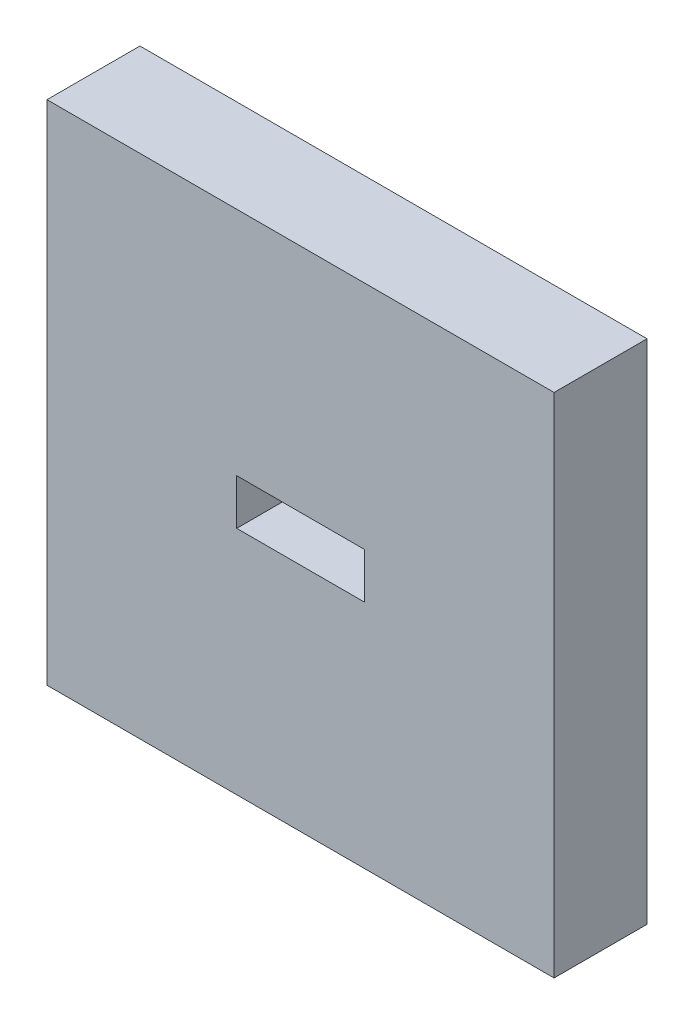
ISO-10303-21;
HEADER;
FILE_DESCRIPTION(('STEP AP214'),'2;1');
FILE_NAME('part.step','',(''),(''),'','','');
FILE_SCHEMA(('AUTOMOTIVE_DESIGN { 1 0 10303 214 1 1 1 1 }'));
ENDSEC;
DATA;
#1=APPLICATION_CONTEXT('core data for automotive mechanical design processes');
#2=APPLICATION_PROTOCOL_DEFINITION('international standard','automotive_design',2000,#1);
#3=PRODUCT_CONTEXT('',#1,'mechanical');
#4=PRODUCT('Part','Part','',(#3));
#5=PRODUCT_RELATED_PRODUCT_CATEGORY('part','',(#4));
#6=PRODUCT_DEFINITION_FORMATION('','',#4);
#7=PRODUCT_DEFINITION_CONTEXT('part definition',#1,'design');
#8=PRODUCT_DEFINITION('design','',#6,#7);
#9=PRODUCT_DEFINITION_SHAPE('','',#8);
#10=(LENGTH_UNIT() NAMED_UNIT(*) SI_UNIT(.MILLI.,.METRE.));
#11=(NAMED_UNIT(*) PLANE_ANGLE_UNIT() SI_UNIT($,.RADIAN.));
#12=(NAMED_UNIT(*) SI_UNIT($,.STERADIAN.) SOLID_ANGLE_UNIT());
#13=UNCERTAINTY_MEASURE_WITH_UNIT(LENGTH_MEASURE(1.E-05),#10,'distance_accuracy_value','');
#14=(GEOMETRIC_REPRESENTATION_CONTEXT(3) GLOBAL_UNCERTAINTY_ASSIGNED_CONTEXT((#13)) GLOBAL_UNIT_ASSIGNED_CONTEXT((#10,
#11,#12)) REPRESENTATION_CONTEXT('',''));
#15=CARTESIAN_POINT('',(0.,0.,0.));
#16=DIRECTION('',(0.,0.,1.));
#17=DIRECTION('',(1.,0.,0.));
#18=AXIS2_PLACEMENT_3D('',#15,#16,#17);
#19=CARTESIAN_POINT('',(0.,0.,110.));
#20=DIRECTION('',(0.,0.,1.));
#21=DIRECTION('',(1.,0.,0.));
#22=AXIS2_PLACEMENT_3D('',#19,#20,#21);
#23=PLANE('',#22);
#24=DIRECTION('',(0.,-1.,0.));
#25=VECTOR('',#24,1.);
#26=CARTESIAN_POINT('',(-224.5,327.,110.));
#27=LINE('',#26,#25);
#28=CARTESIAN_POINT('',(-224.5,327.,110.));
#29=VERTEX_POINT('',#28);
#30=CARTESIAN_POINT('',(-224.5,-273.,110.));
#31=VERTEX_POINT('',#30);
#32=EDGE_CURVE('E137',#29,#31,#27,.T.);
#33=ORIENTED_EDGE('',*,*,#32,.T.);
#34=DIRECTION('',(1.,0.,0.));
#35=VECTOR('',#34,1.);
#36=CARTESIAN_POINT('',(-224.5,-273.,110.));
#37=LINE('',#36,#35);
#38=CARTESIAN_POINT('',(375.5,-273.,110.));
#39=VERTEX_POINT('',#38);
#40=EDGE_CURVE('E140',#31,#39,#37,.T.);
#41=ORIENTED_EDGE('',*,*,#40,.T.);
#42=DIRECTION('',(0.,1.,0.));
#43=VECTOR('',#42,1.);
#44=CARTESIAN_POINT('',(375.5,327.,110.));
#45=LINE('',#44,#43);
#46=CARTESIAN_POINT('',(375.5,327.,110.));
#47=VERTEX_POINT('',#46);
#48=EDGE_CURVE('E143',#39,#47,#45,.T.);
#49=ORIENTED_EDGE('',*,*,#48,.T.);
#50=DIRECTION('',(-1.,0.,0.));
#51=VECTOR('',#50,1.);
#52=CARTESIAN_POINT('',(-224.5,327.,110.));
#53=LINE('',#52,#51);
#54=EDGE_CURVE('E145',#47,#29,#53,.T.);
#55=ORIENTED_EDGE('',*,*,#54,.T.);
#56=EDGE_LOOP('',(#33,#41,#49,#55));
#57=FACE_BOUND('',#56,.T.);
#58=DIRECTION('',(1.,0.,0.));
#59=VECTOR('',#58,1.);
#60=CARTESIAN_POINT('',(0.,0.,110.));
#61=LINE('',#60,#59);
#62=CARTESIAN_POINT('',(0.,0.,110.));
#63=VERTEX_POINT('',#62);
#64=CARTESIAN_POINT('',(151.,0.,110.));
#65=VERTEX_POINT('',#64);
#66=EDGE_CURVE('E109',#63,#65,#61,.T.);
#67=ORIENTED_EDGE('',*,*,#66,.F.);
#68=DIRECTION('',(0.,-1.,0.));
#69=VECTOR('',#68,1.);
#70=CARTESIAN_POINT('',(0.,0.,110.));
#71=LINE('',#70,#69);
#72=CARTESIAN_POINT('',(0.,54.,110.));
#73=VERTEX_POINT('',#72);
#74=EDGE_CURVE('E101',#73,#63,#71,.T.);
#75=ORIENTED_EDGE('',*,*,#74,.F.);
#76=DIRECTION('',(-1.,0.,0.));
#77=VECTOR('',#76,1.);
#78=CARTESIAN_POINT('',(0.,54.,110.));
#79=LINE('',#78,#77);
#80=CARTESIAN_POINT('',(151.,54.,110.));
#81=VERTEX_POINT('',#80);
#82=EDGE_CURVE('E123',#81,#73,#79,.T.);
#83=ORIENTED_EDGE('',*,*,#82,.F.);
#84=DIRECTION('',(0.,1.,0.));
#85=VECTOR('',#84,1.);
#86=CARTESIAN_POINT('',(151.,0.,110.));
#87=LINE('',#86,#85);
#88=EDGE_CURVE('E121',#65,#81,#87,.T.);
#89=ORIENTED_EDGE('',*,*,#88,.F.);
#90=EDGE_LOOP('',(#67,#75,#83,#89));
#91=FACE_BOUND('',#90,.T.);
#92=ADVANCED_FACE('F36',(#57,#91),#23,.T.);
#93=CARTESIAN_POINT('',(0.,0.,0.));
#94=DIRECTION('',(0.,0.,1.));
#95=DIRECTION('',(1.,0.,0.));
#96=AXIS2_PLACEMENT_3D('',#93,#94,#95);
#97=PLANE('',#96);
#98=DIRECTION('',(0.,-1.,0.));
#99=VECTOR('',#98,1.);
#100=CARTESIAN_POINT('',(-224.5,327.,0.));
#101=LINE('',#100,#99);
#102=CARTESIAN_POINT('',(-224.5,327.,0.));
#103=VERTEX_POINT('',#102);
#104=CARTESIAN_POINT('',(-224.5,-273.,0.));
#105=VERTEX_POINT('',#104);
#106=EDGE_CURVE('E117',#103,#105,#101,.T.);
#107=ORIENTED_EDGE('',*,*,#106,.F.);
#108=DIRECTION('',(-1.,0.,0.));
#109=VECTOR('',#108,1.);
#110=CARTESIAN_POINT('',(-224.5,327.,0.));
#111=LINE('',#110,#109);
#112=CARTESIAN_POINT('',(375.5,327.,0.));
#113=VERTEX_POINT('',#112);
#114=EDGE_CURVE('E141',#113,#103,#111,.T.);
#115=ORIENTED_EDGE('',*,*,#114,.F.);
#116=DIRECTION('',(0.,1.,0.));
#117=VECTOR('',#116,1.);
#118=CARTESIAN_POINT('',(375.5,327.,0.));
#119=LINE('',#118,#117);
#120=CARTESIAN_POINT('',(375.5,-273.,0.));
#121=VERTEX_POINT('',#120);
#122=EDGE_CURVE('E152',#121,#113,#119,.T.);
#123=ORIENTED_EDGE('',*,*,#122,.F.);
#124=DIRECTION('',(1.,0.,0.));
#125=VECTOR('',#124,1.);
#126=CARTESIAN_POINT('',(-224.5,-273.,0.));
#127=LINE('',#126,#125);
#128=EDGE_CURVE('E150',#105,#121,#127,.T.);
#129=ORIENTED_EDGE('',*,*,#128,.F.);
#130=EDGE_LOOP('',(#107,#115,#123,#129));
#131=FACE_BOUND('',#130,.T.);
#132=DIRECTION('',(0.,-1.,0.));
#133=VECTOR('',#132,1.);
#134=CARTESIAN_POINT('',(0.,0.,0.));
#135=LINE('',#134,#133);
#136=CARTESIAN_POINT('',(0.,54.,0.));
#137=VERTEX_POINT('',#136);
#138=CARTESIAN_POINT('',(0.,0.,0.));
#139=VERTEX_POINT('',#138);
#140=EDGE_CURVE('E59',#137,#139,#135,.T.);
#141=ORIENTED_EDGE('',*,*,#140,.T.);
#142=DIRECTION('',(1.,0.,0.));
#143=VECTOR('',#142,1.);
#144=CARTESIAN_POINT('',(0.,0.,0.));
#145=LINE('',#144,#143);
#146=CARTESIAN_POINT('',(151.,0.,0.));
#147=VERTEX_POINT('',#146);
#148=EDGE_CURVE('E116',#139,#147,#145,.T.);
#149=ORIENTED_EDGE('',*,*,#148,.T.);
#150=DIRECTION('',(0.,1.,0.));
#151=VECTOR('',#150,1.);
#152=CARTESIAN_POINT('',(151.,0.,0.));
#153=LINE('',#152,#151);
#154=CARTESIAN_POINT('',(151.,54.,0.));
#155=VERTEX_POINT('',#154);
#156=EDGE_CURVE('E129',#147,#155,#153,.T.);
#157=ORIENTED_EDGE('',*,*,#156,.T.);
#158=DIRECTION('',(-1.,0.,0.));
#159=VECTOR('',#158,1.);
#160=CARTESIAN_POINT('',(0.,54.,0.));
#161=LINE('',#160,#159);
#162=EDGE_CURVE('E110',#155,#137,#161,.T.);
#163=ORIENTED_EDGE('',*,*,#162,.T.);
#164=EDGE_LOOP('',(#141,#149,#157,#163));
#165=FACE_BOUND('',#164,.T.);
#166=ADVANCED_FACE('F170',(#131,#165),#97,.F.);
#167=CARTESIAN_POINT('',(-224.5,327.,110.));
#168=DIRECTION('',(1.,0.,0.));
#169=DIRECTION('',(0.,0.,-1.));
#170=AXIS2_PLACEMENT_3D('',#167,#168,#169);
#171=PLANE('',#170);
#172=ORIENTED_EDGE('',*,*,#106,.T.);
#173=DIRECTION('',(0.,0.,-1.));
#174=VECTOR('',#173,1.);
#175=CARTESIAN_POINT('',(-224.5,-273.,110.));
#176=LINE('',#175,#174);
#177=EDGE_CURVE('E11',#31,#105,#176,.T.);
#178=ORIENTED_EDGE('',*,*,#177,.F.);
#179=ORIENTED_EDGE('',*,*,#32,.F.);
#180=DIRECTION('',(0.,0.,-1.));
#181=VECTOR('',#180,1.);
#182=CARTESIAN_POINT('',(-224.5,327.,110.));
#183=LINE('',#182,#181);
#184=EDGE_CURVE('E147',#29,#103,#183,.T.);
#185=ORIENTED_EDGE('',*,*,#184,.T.);
#186=EDGE_LOOP('',(#172,#178,#179,#185));
#187=FACE_BOUND('',#186,.T.);
#188=ADVANCED_FACE('F38',(#187),#171,.F.);
#189=CARTESIAN_POINT('',(-224.5,-273.,110.));
#190=DIRECTION('',(0.,1.,0.));
#191=DIRECTION('',(0.,0.,1.));
#192=AXIS2_PLACEMENT_3D('',#189,#190,#191);
#193=PLANE('',#192);
#194=ORIENTED_EDGE('',*,*,#128,.T.);
#195=DIRECTION('',(0.,0.,-1.));
#196=VECTOR('',#195,1.);
#197=CARTESIAN_POINT('',(375.5,-273.,110.));
#198=LINE('',#197,#196);
#199=EDGE_CURVE('E44',#39,#121,#198,.T.);
#200=ORIENTED_EDGE('',*,*,#199,.F.);
#201=ORIENTED_EDGE('',*,*,#40,.F.);
#202=ORIENTED_EDGE('',*,*,#177,.T.);
#203=EDGE_LOOP('',(#194,#200,#201,#202));
#204=FACE_BOUND('',#203,.T.);
#205=ADVANCED_FACE('F180',(#204),#193,.F.);
#206=CARTESIAN_POINT('',(375.5,327.,110.));
#207=DIRECTION('',(-1.,0.,0.));
#208=DIRECTION('',(0.,0.,1.));
#209=AXIS2_PLACEMENT_3D('',#206,#207,#208);
#210=PLANE('',#209);
#211=ORIENTED_EDGE('',*,*,#122,.T.);
#212=DIRECTION('',(0.,0.,-1.));
#213=VECTOR('',#212,1.);
#214=CARTESIAN_POINT('',(375.5,327.,110.));
#215=LINE('',#214,#213);
#216=EDGE_CURVE('E157',#47,#113,#215,.T.);
#217=ORIENTED_EDGE('',*,*,#216,.F.);
#218=ORIENTED_EDGE('',*,*,#48,.F.);
#219=ORIENTED_EDGE('',*,*,#199,.T.);
#220=EDGE_LOOP('',(#211,#217,#218,#219));
#221=FACE_BOUND('',#220,.T.);
#222=ADVANCED_FACE('F164',(#221),#210,.F.);
#223=CARTESIAN_POINT('',(-224.5,327.,110.));
#224=DIRECTION('',(0.,-1.,0.));
#225=DIRECTION('',(0.,0.,-1.));
#226=AXIS2_PLACEMENT_3D('',#223,#224,#225);
#227=PLANE('',#226);
#228=ORIENTED_EDGE('',*,*,#114,.T.);
#229=ORIENTED_EDGE('',*,*,#184,.F.);
#230=ORIENTED_EDGE('',*,*,#54,.F.);
#231=ORIENTED_EDGE('',*,*,#216,.T.);
#232=EDGE_LOOP('',(#228,#229,#230,#231));
#233=FACE_BOUND('',#232,.T.);
#234=ADVANCED_FACE('F174',(#233),#227,.F.);
#235=CARTESIAN_POINT('',(0.,0.,110.));
#236=DIRECTION('',(1.,0.,0.));
#237=DIRECTION('',(0.,0.,-1.));
#238=AXIS2_PLACEMENT_3D('',#235,#236,#237);
#239=PLANE('',#238);
#240=ORIENTED_EDGE('',*,*,#140,.F.);
#241=DIRECTION('',(0.,0.,-1.));
#242=VECTOR('',#241,1.);
#243=CARTESIAN_POINT('',(0.,54.,110.));
#244=LINE('',#243,#242);
#245=EDGE_CURVE('E105',#73,#137,#244,.T.);
#246=ORIENTED_EDGE('',*,*,#245,.F.);
#247=ORIENTED_EDGE('',*,*,#74,.T.);
#248=DIRECTION('',(0.,0.,-1.));
#249=VECTOR('',#248,1.);
#250=CARTESIAN_POINT('',(0.,0.,110.));
#251=LINE('',#250,#249);
#252=EDGE_CURVE('E104',#63,#139,#251,.T.);
#253=ORIENTED_EDGE('',*,*,#252,.T.);
#254=EDGE_LOOP('',(#240,#246,#247,#253));
#255=FACE_BOUND('',#254,.T.);
#256=ADVANCED_FACE('F103',(#255),#239,.T.);
#257=CARTESIAN_POINT('',(0.,0.,110.));
#258=DIRECTION('',(0.,1.,0.));
#259=DIRECTION('',(0.,0.,1.));
#260=AXIS2_PLACEMENT_3D('',#257,#258,#259);
#261=PLANE('',#260);
#262=ORIENTED_EDGE('',*,*,#148,.F.);
#263=ORIENTED_EDGE('',*,*,#252,.F.);
#264=ORIENTED_EDGE('',*,*,#66,.T.);
#265=DIRECTION('',(0.,0.,-1.));
#266=VECTOR('',#265,1.);
#267=CARTESIAN_POINT('',(151.,0.,110.));
#268=LINE('',#267,#266);
#269=EDGE_CURVE('E118',#65,#147,#268,.T.);
#270=ORIENTED_EDGE('',*,*,#269,.T.);
#271=EDGE_LOOP('',(#262,#263,#264,#270));
#272=FACE_BOUND('',#271,.T.);
#273=ADVANCED_FACE('F113',(#272),#261,.T.);
#274=CARTESIAN_POINT('',(151.,0.,110.));
#275=DIRECTION('',(-1.,0.,0.));
#276=DIRECTION('',(0.,0.,1.));
#277=AXIS2_PLACEMENT_3D('',#274,#275,#276);
#278=PLANE('',#277);
#279=ORIENTED_EDGE('',*,*,#156,.F.);
#280=ORIENTED_EDGE('',*,*,#269,.F.);
#281=ORIENTED_EDGE('',*,*,#88,.T.);
#282=DIRECTION('',(0.,0.,-1.));
#283=VECTOR('',#282,1.);
#284=CARTESIAN_POINT('',(151.,54.,110.));
#285=LINE('',#284,#283);
#286=EDGE_CURVE('E51',#81,#155,#285,.T.);
#287=ORIENTED_EDGE('',*,*,#286,.T.);
#288=EDGE_LOOP('',(#279,#280,#281,#287));
#289=FACE_BOUND('',#288,.T.);
#290=ADVANCED_FACE('F203',(#289),#278,.T.);
#291=CARTESIAN_POINT('',(0.,54.,110.));
#292=DIRECTION('',(0.,-1.,0.));
#293=DIRECTION('',(0.,0.,-1.));
#294=AXIS2_PLACEMENT_3D('',#291,#292,#293);
#295=PLANE('',#294);
#296=ORIENTED_EDGE('',*,*,#162,.F.);
#297=ORIENTED_EDGE('',*,*,#286,.F.);
#298=ORIENTED_EDGE('',*,*,#82,.T.);
#299=ORIENTED_EDGE('',*,*,#245,.T.);
#300=EDGE_LOOP('',(#296,#297,#298,#299));
#301=FACE_BOUND('',#300,.T.);
#302=ADVANCED_FACE('F207',(#301),#295,.T.);
#303=CLOSED_SHELL('',(#92,#166,#188,#205,#222,#234,#256,#273,#290,#302));
#304=MANIFOLD_SOLID_BREP('B2',#303);
#305=ADVANCED_BREP_SHAPE_REPRESENTATION('',(#18,#304),#14);
#306=SHAPE_DEFINITION_REPRESENTATION(#9,#305);
ENDSEC;
END-ISO-10303-21;
